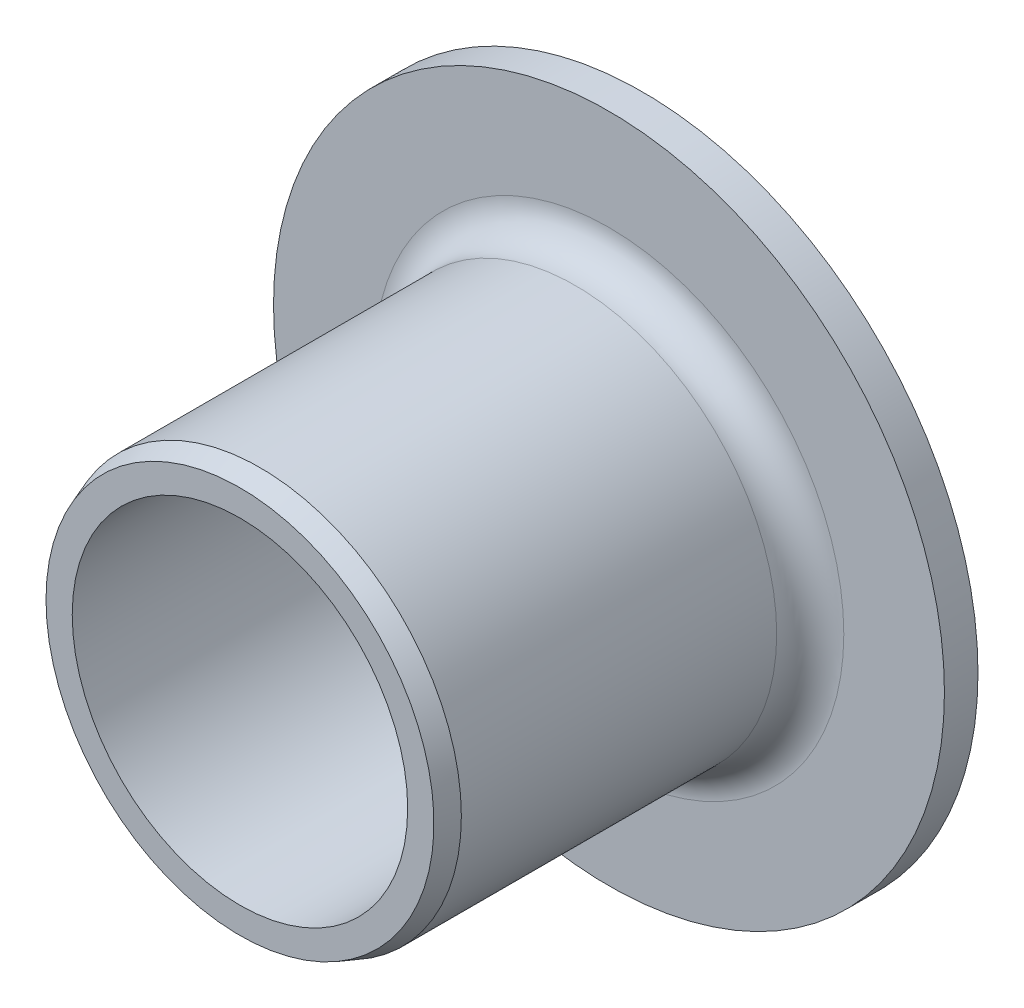
ISO-10303-21;
HEADER;
FILE_DESCRIPTION(('STEP AP214'),'2;1');
FILE_NAME('part.step','',(''),(''),'','','');
FILE_SCHEMA(('AUTOMOTIVE_DESIGN { 1 0 10303 214 1 1 1 1 }'));
ENDSEC;
DATA;
#1=APPLICATION_CONTEXT('core data for automotive mechanical design processes');
#2=APPLICATION_PROTOCOL_DEFINITION('international standard','automotive_design',2000,#1);
#3=PRODUCT_CONTEXT('',#1,'mechanical');
#4=PRODUCT('Part','Part','',(#3));
#5=PRODUCT_RELATED_PRODUCT_CATEGORY('part','',(#4));
#6=PRODUCT_DEFINITION_FORMATION('','',#4);
#7=PRODUCT_DEFINITION_CONTEXT('part definition',#1,'design');
#8=PRODUCT_DEFINITION('design','',#6,#7);
#9=PRODUCT_DEFINITION_SHAPE('','',#8);
#10=(LENGTH_UNIT() NAMED_UNIT(*) SI_UNIT(.MILLI.,.METRE.));
#11=(NAMED_UNIT(*) PLANE_ANGLE_UNIT() SI_UNIT($,.RADIAN.));
#12=(NAMED_UNIT(*) SI_UNIT($,.STERADIAN.) SOLID_ANGLE_UNIT());
#13=UNCERTAINTY_MEASURE_WITH_UNIT(LENGTH_MEASURE(1.E-05),#10,'distance_accuracy_value','');
#14=(GEOMETRIC_REPRESENTATION_CONTEXT(3) GLOBAL_UNCERTAINTY_ASSIGNED_CONTEXT((#13)) GLOBAL_UNIT_ASSIGNED_CONTEXT((#10,
#11,#12)) REPRESENTATION_CONTEXT('',''));
#15=CARTESIAN_POINT('',(0.,0.,0.));
#16=DIRECTION('',(0.,0.,1.));
#17=DIRECTION('',(1.,0.,0.));
#18=AXIS2_PLACEMENT_3D('',#15,#16,#17);
#19=CARTESIAN_POINT('',(0.,0.,3.35));
#20=DIRECTION('',(0.,0.,-1.));
#21=DIRECTION('',(-1.,0.,0.));
#22=AXIS2_PLACEMENT_3D('',#19,#20,#21);
#23=CYLINDRICAL_SURFACE('',#22,3.);
#24=CARTESIAN_POINT('',(0.,0.,5.69999999999027));
#25=DIRECTION('',(0.,0.,-1.));
#26=DIRECTION('',(1.,0.,0.));
#27=AXIS2_PLACEMENT_3D('',#24,#25,#26);
#28=CIRCLE('',#27,3.00000000004275);
#29=CARTESIAN_POINT('',(3.00000000004275,0.,5.69999999999027));
#30=VERTEX_POINT('',#29);
#31=EDGE_CURVE('E39',#30,#30,#28,.F.);
#32=ORIENTED_EDGE('',*,*,#31,.F.);
#33=EDGE_LOOP('',(#32));
#34=FACE_BOUND('',#33,.T.);
#35=CARTESIAN_POINT('',(0.,0.,1.));
#36=DIRECTION('',(0.,0.,1.));
#37=DIRECTION('',(1.,0.,0.));
#38=AXIS2_PLACEMENT_3D('',#35,#36,#37);
#39=CIRCLE('',#38,3.);
#40=CARTESIAN_POINT('',(3.,0.,1.));
#41=VERTEX_POINT('',#40);
#42=EDGE_CURVE('E83',#41,#41,#39,.T.);
#43=ORIENTED_EDGE('',*,*,#42,.T.);
#44=EDGE_LOOP('',(#43));
#45=FACE_BOUND('',#44,.T.);
#46=ADVANCED_FACE('F15',(#34,#45),#23,.T.);
#47=CARTESIAN_POINT('',(0.,0.,1.));
#48=DIRECTION('',(0.,0.,1.));
#49=DIRECTION('',(1.,0.,0.));
#50=AXIS2_PLACEMENT_3D('',#47,#48,#49);
#51=TOROIDAL_SURFACE('',#50,3.5,0.500000000000001);
#52=CARTESIAN_POINT('',(0.,0.,0.499999999999999));
#53=DIRECTION('',(0.,0.,1.));
#54=DIRECTION('',(-1.,0.,0.));
#55=AXIS2_PLACEMENT_3D('',#52,#53,#54);
#56=CIRCLE('',#55,3.5);
#57=CARTESIAN_POINT('',(3.5,0.,0.499999999999999));
#58=VERTEX_POINT('',#57);
#59=CARTESIAN_POINT('',(-3.5,0.,0.499999999999999));
#60=VERTEX_POINT('',#59);
#61=EDGE_CURVE('E31',#58,#60,#56,.F.);
#62=ORIENTED_EDGE('',*,*,#61,.F.);
#63=CARTESIAN_POINT('',(0.,0.,0.499999999999999));
#64=DIRECTION('',(0.,0.,1.));
#65=DIRECTION('',(1.,0.,0.));
#66=AXIS2_PLACEMENT_3D('',#63,#64,#65);
#67=CIRCLE('',#66,3.5);
#68=EDGE_CURVE('E34',#60,#58,#67,.F.);
#69=ORIENTED_EDGE('',*,*,#68,.F.);
#70=EDGE_LOOP('',(#62,#69));
#71=FACE_BOUND('',#70,.T.);
#72=ORIENTED_EDGE('',*,*,#42,.F.);
#73=EDGE_LOOP('',(#72));
#74=FACE_BOUND('',#73,.T.);
#75=ADVANCED_FACE('F35',(#71,#74),#51,.F.);
#76=CARTESIAN_POINT('',(0.,0.,5.7000000001608));
#77=DIRECTION('',(0.,0.,-1.));
#78=DIRECTION('',(-1.,0.,0.));
#79=AXIS2_PLACEMENT_3D('',#76,#77,#78);
#80=CONICAL_SURFACE('',#79,2.99999999995748,0.349065850399206);
#81=CARTESIAN_POINT('',(0.,0.,6.00000000002865));
#82=DIRECTION('',(0.,0.,-1.));
#83=DIRECTION('',(-1.,0.,0.));
#84=AXIS2_PLACEMENT_3D('',#81,#82,#83);
#85=CIRCLE('',#84,2.8908089297256);
#86=CARTESIAN_POINT('',(-2.8908089297256,0.,6.00000000002865));
#87=VERTEX_POINT('',#86);
#88=EDGE_CURVE('E43',#87,#87,#85,.F.);
#89=ORIENTED_EDGE('',*,*,#88,.F.);
#90=EDGE_LOOP('',(#89));
#91=FACE_BOUND('',#90,.T.);
#92=ORIENTED_EDGE('',*,*,#31,.T.);
#93=EDGE_LOOP('',(#92));
#94=FACE_BOUND('',#93,.T.);
#95=ADVANCED_FACE('F63',(#91,#94),#80,.T.);
#96=CARTESIAN_POINT('',(4.25,0.,0.5));
#97=DIRECTION('',(0.,0.,1.));
#98=DIRECTION('',(1.,0.,0.));
#99=AXIS2_PLACEMENT_3D('',#96,#97,#98);
#100=PLANE('',#99);
#101=CARTESIAN_POINT('',(0.,0.,0.5));
#102=DIRECTION('',(0.,0.,-1.));
#103=DIRECTION('',(-1.,0.,0.));
#104=AXIS2_PLACEMENT_3D('',#101,#102,#103);
#105=CIRCLE('',#104,5.);
#106=CARTESIAN_POINT('',(-5.,0.,0.5));
#107=VERTEX_POINT('',#106);
#108=EDGE_CURVE('E91',#107,#107,#105,.T.);
#109=ORIENTED_EDGE('',*,*,#108,.F.);
#110=EDGE_LOOP('',(#109));
#111=FACE_BOUND('',#110,.T.);
#112=ORIENTED_EDGE('',*,*,#68,.T.);
#113=ORIENTED_EDGE('',*,*,#61,.T.);
#114=EDGE_LOOP('',(#112,#113));
#115=FACE_BOUND('',#114,.T.);
#116=ADVANCED_FACE('F42',(#111,#115),#100,.T.);
#117=CARTESIAN_POINT('',(2.69540446486007,0.,6.));
#118=DIRECTION('',(0.,0.,1.));
#119=DIRECTION('',(1.,0.,0.));
#120=AXIS2_PLACEMENT_3D('',#117,#118,#119);
#121=PLANE('',#120);
#122=ORIENTED_EDGE('',*,*,#88,.T.);
#123=EDGE_LOOP('',(#122));
#124=FACE_BOUND('',#123,.T.);
#125=CARTESIAN_POINT('',(0.,0.,6.));
#126=DIRECTION('',(0.,0.,-1.));
#127=DIRECTION('',(-1.,0.,0.));
#128=AXIS2_PLACEMENT_3D('',#125,#126,#127);
#129=CIRCLE('',#128,2.5);
#130=CARTESIAN_POINT('',(-2.5,0.,6.));
#131=VERTEX_POINT('',#130);
#132=EDGE_CURVE('E88',#131,#131,#129,.T.);
#133=ORIENTED_EDGE('',*,*,#132,.T.);
#134=EDGE_LOOP('',(#133));
#135=FACE_BOUND('',#134,.T.);
#136=ADVANCED_FACE('F62',(#124,#135),#121,.T.);
#137=CARTESIAN_POINT('',(0.,0.,0.25));
#138=DIRECTION('',(0.,0.,-1.));
#139=DIRECTION('',(-1.,0.,0.));
#140=AXIS2_PLACEMENT_3D('',#137,#138,#139);
#141=CYLINDRICAL_SURFACE('',#140,5.);
#142=ORIENTED_EDGE('',*,*,#108,.T.);
#143=EDGE_LOOP('',(#142));
#144=FACE_BOUND('',#143,.T.);
#145=CARTESIAN_POINT('',(0.,0.,0.));
#146=DIRECTION('',(0.,0.,-1.));
#147=DIRECTION('',(-1.,0.,0.));
#148=AXIS2_PLACEMENT_3D('',#145,#146,#147);
#149=CIRCLE('',#148,5.);
#150=CARTESIAN_POINT('',(-5.,0.,0.));
#151=VERTEX_POINT('',#150);
#152=EDGE_CURVE('E24',#151,#151,#149,.T.);
#153=ORIENTED_EDGE('',*,*,#152,.F.);
#154=EDGE_LOOP('',(#153));
#155=FACE_BOUND('',#154,.T.);
#156=ADVANCED_FACE('F114',(#144,#155),#141,.T.);
#157=CARTESIAN_POINT('',(0.,0.,3.));
#158=DIRECTION('',(0.,0.,-1.));
#159=DIRECTION('',(-1.,0.,0.));
#160=AXIS2_PLACEMENT_3D('',#157,#158,#159);
#161=CYLINDRICAL_SURFACE('',#160,2.5);
#162=CARTESIAN_POINT('',(0.,0.,0.));
#163=DIRECTION('',(0.,0.,-1.));
#164=DIRECTION('',(-1.,0.,0.));
#165=AXIS2_PLACEMENT_3D('',#162,#163,#164);
#166=CIRCLE('',#165,2.5);
#167=CARTESIAN_POINT('',(-2.5,0.,0.));
#168=VERTEX_POINT('',#167);
#169=EDGE_CURVE('E10',#168,#168,#166,.F.);
#170=ORIENTED_EDGE('',*,*,#169,.F.);
#171=EDGE_LOOP('',(#170));
#172=FACE_BOUND('',#171,.T.);
#173=ORIENTED_EDGE('',*,*,#132,.F.);
#174=EDGE_LOOP('',(#173));
#175=FACE_BOUND('',#174,.T.);
#176=ADVANCED_FACE('F108',(#172,#175),#161,.F.);
#177=CARTESIAN_POINT('',(3.75,0.,0.));
#178=DIRECTION('',(0.,0.,-1.));
#179=DIRECTION('',(-1.,0.,0.));
#180=AXIS2_PLACEMENT_3D('',#177,#178,#179);
#181=PLANE('',#180);
#182=ORIENTED_EDGE('',*,*,#169,.T.);
#183=EDGE_LOOP('',(#182));
#184=FACE_BOUND('',#183,.T.);
#185=ORIENTED_EDGE('',*,*,#152,.T.);
#186=EDGE_LOOP('',(#185));
#187=FACE_BOUND('',#186,.T.);
#188=ADVANCED_FACE('F106',(#184,#187),#181,.T.);
#189=CLOSED_SHELL('',(#46,#75,#95,#116,#136,#156,#176,#188));
#190=MANIFOLD_SOLID_BREP('B1',#189);
#191=ADVANCED_BREP_SHAPE_REPRESENTATION('',(#18,#190),#14);
#192=SHAPE_DEFINITION_REPRESENTATION(#9,#191);
ENDSEC;
END-ISO-10303-21;
